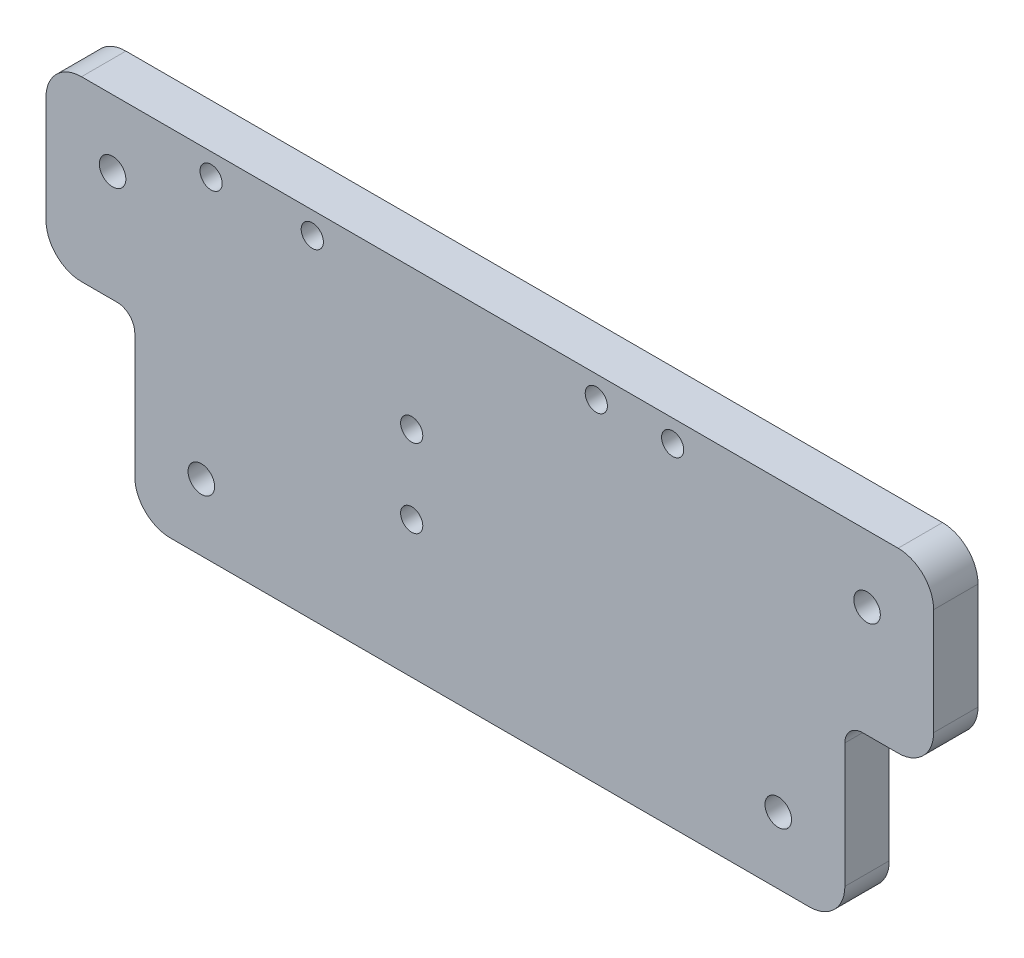
ISO-10303-21;
HEADER;
FILE_DESCRIPTION(('STEP AP214'),'2;1');
FILE_NAME('part.step','',(''),(''),'','','');
FILE_SCHEMA(('AUTOMOTIVE_DESIGN { 1 0 10303 214 1 1 1 1 }'));
ENDSEC;
DATA;
#1=APPLICATION_CONTEXT('core data for automotive mechanical design processes');
#2=APPLICATION_PROTOCOL_DEFINITION('international standard','automotive_design',2000,#1);
#3=PRODUCT_CONTEXT('',#1,'mechanical');
#4=PRODUCT('Part','Part','',(#3));
#5=PRODUCT_RELATED_PRODUCT_CATEGORY('part','',(#4));
#6=PRODUCT_DEFINITION_FORMATION('','',#4);
#7=PRODUCT_DEFINITION_CONTEXT('part definition',#1,'design');
#8=PRODUCT_DEFINITION('design','',#6,#7);
#9=PRODUCT_DEFINITION_SHAPE('','',#8);
#10=(LENGTH_UNIT() NAMED_UNIT(*) SI_UNIT(.MILLI.,.METRE.));
#11=(NAMED_UNIT(*) PLANE_ANGLE_UNIT() SI_UNIT($,.RADIAN.));
#12=(NAMED_UNIT(*) SI_UNIT($,.STERADIAN.) SOLID_ANGLE_UNIT());
#13=UNCERTAINTY_MEASURE_WITH_UNIT(LENGTH_MEASURE(1.E-05),#10,'distance_accuracy_value','');
#14=(GEOMETRIC_REPRESENTATION_CONTEXT(3) GLOBAL_UNCERTAINTY_ASSIGNED_CONTEXT((#13)) GLOBAL_UNIT_ASSIGNED_CONTEXT((#10,
#11,#12)) REPRESENTATION_CONTEXT('',''));
#15=CARTESIAN_POINT('',(0.,0.,0.));
#16=DIRECTION('',(0.,0.,1.));
#17=DIRECTION('',(1.,0.,0.));
#18=AXIS2_PLACEMENT_3D('',#15,#16,#17);
#19=CARTESIAN_POINT('',(114.3,0.,6.35));
#20=DIRECTION('',(1.,0.,0.));
#21=DIRECTION('',(0.,0.,-1.));
#22=AXIS2_PLACEMENT_3D('',#19,#20,#21);
#23=PLANE('',#22);
#24=DIRECTION('',(0.,-1.,0.));
#25=VECTOR('',#24,1.);
#26=CARTESIAN_POINT('',(114.3,0.,0.));
#27=LINE('',#26,#25);
#28=CARTESIAN_POINT('',(114.3,22.86,0.));
#29=VERTEX_POINT('',#28);
#30=CARTESIAN_POINT('',(114.3,5.08,0.));
#31=VERTEX_POINT('',#30);
#32=EDGE_CURVE('E259',#29,#31,#27,.T.);
#33=ORIENTED_EDGE('',*,*,#32,.F.);
#34=DIRECTION('',(0.,0.,-1.));
#35=VECTOR('',#34,1.);
#36=CARTESIAN_POINT('',(114.3,22.86,6.35));
#37=LINE('',#36,#35);
#38=CARTESIAN_POINT('',(114.3,22.86,6.35));
#39=VERTEX_POINT('',#38);
#40=EDGE_CURVE('E228',#29,#39,#37,.F.);
#41=ORIENTED_EDGE('',*,*,#40,.T.);
#42=DIRECTION('',(0.,-1.,0.));
#43=VECTOR('',#42,1.);
#44=CARTESIAN_POINT('',(114.3,0.,6.35));
#45=LINE('',#44,#43);
#46=CARTESIAN_POINT('',(114.3,5.08,6.35));
#47=VERTEX_POINT('',#46);
#48=EDGE_CURVE('E246',#39,#47,#45,.T.);
#49=ORIENTED_EDGE('',*,*,#48,.T.);
#50=DIRECTION('',(0.,0.,-1.));
#51=VECTOR('',#50,1.);
#52=CARTESIAN_POINT('',(114.3,5.08,0.));
#53=LINE('',#52,#51);
#54=EDGE_CURVE('E210',#47,#31,#53,.T.);
#55=ORIENTED_EDGE('',*,*,#54,.T.);
#56=EDGE_LOOP('',(#33,#41,#49,#55));
#57=FACE_BOUND('',#56,.T.);
#58=ADVANCED_FACE('F34',(#57),#23,.T.);
#59=CARTESIAN_POINT('',(0.,25.4,6.35));
#60=DIRECTION('',(0.,-1.,0.));
#61=DIRECTION('',(1.,0.,0.));
#62=AXIS2_PLACEMENT_3D('',#59,#60,#61);
#63=PLANE('',#62);
#64=DIRECTION('',(-1.,0.,0.));
#65=VECTOR('',#64,1.);
#66=CARTESIAN_POINT('',(0.,25.4,6.35));
#67=LINE('',#66,#65);
#68=CARTESIAN_POINT('',(121.92,25.4,6.35));
#69=VERTEX_POINT('',#68);
#70=CARTESIAN_POINT('',(116.84,25.4,6.35));
#71=VERTEX_POINT('',#70);
#72=EDGE_CURVE('E244',#69,#71,#67,.T.);
#73=ORIENTED_EDGE('',*,*,#72,.T.);
#74=DIRECTION('',(0.,0.,-1.));
#75=VECTOR('',#74,1.);
#76=CARTESIAN_POINT('',(116.84,25.4,0.));
#77=LINE('',#76,#75);
#78=CARTESIAN_POINT('',(116.84,25.4,0.));
#79=VERTEX_POINT('',#78);
#80=EDGE_CURVE('E225',#71,#79,#77,.T.);
#81=ORIENTED_EDGE('',*,*,#80,.T.);
#82=DIRECTION('',(-1.,0.,0.));
#83=VECTOR('',#82,1.);
#84=CARTESIAN_POINT('',(0.,25.4,0.));
#85=LINE('',#84,#83);
#86=CARTESIAN_POINT('',(121.92,25.4,0.));
#87=VERTEX_POINT('',#86);
#88=EDGE_CURVE('E261',#87,#79,#85,.T.);
#89=ORIENTED_EDGE('',*,*,#88,.F.);
#90=DIRECTION('',(0.,0.,-1.));
#91=VECTOR('',#90,1.);
#92=CARTESIAN_POINT('',(121.92,25.4,6.35));
#93=LINE('',#92,#91);
#94=EDGE_CURVE('E218',#87,#69,#93,.F.);
#95=ORIENTED_EDGE('',*,*,#94,.T.);
#96=EDGE_LOOP('',(#73,#81,#89,#95));
#97=FACE_BOUND('',#96,.T.);
#98=ADVANCED_FACE('F251',(#97),#63,.T.);
#99=CARTESIAN_POINT('',(127.,0.,6.35));
#100=DIRECTION('',(-1.,0.,0.));
#101=DIRECTION('',(0.,0.,1.));
#102=AXIS2_PLACEMENT_3D('',#99,#100,#101);
#103=PLANE('',#102);
#104=DIRECTION('',(0.,1.,0.));
#105=VECTOR('',#104,1.);
#106=CARTESIAN_POINT('',(127.,0.,6.35));
#107=LINE('',#106,#105);
#108=CARTESIAN_POINT('',(127.,30.48,6.35));
#109=VERTEX_POINT('',#108);
#110=CARTESIAN_POINT('',(127.,45.72,6.35));
#111=VERTEX_POINT('',#110);
#112=EDGE_CURVE('E255',#109,#111,#107,.T.);
#113=ORIENTED_EDGE('',*,*,#112,.F.);
#114=DIRECTION('',(0.,0.,-1.));
#115=VECTOR('',#114,1.);
#116=CARTESIAN_POINT('',(127.,30.48,0.));
#117=LINE('',#116,#115);
#118=CARTESIAN_POINT('',(127.,30.48,0.));
#119=VERTEX_POINT('',#118);
#120=EDGE_CURVE('E215',#109,#119,#117,.T.);
#121=ORIENTED_EDGE('',*,*,#120,.T.);
#122=DIRECTION('',(0.,1.,0.));
#123=VECTOR('',#122,1.);
#124=CARTESIAN_POINT('',(127.,0.,0.));
#125=LINE('',#124,#123);
#126=CARTESIAN_POINT('',(127.,45.72,0.));
#127=VERTEX_POINT('',#126);
#128=EDGE_CURVE('E266',#119,#127,#125,.T.);
#129=ORIENTED_EDGE('',*,*,#128,.T.);
#130=DIRECTION('',(0.,0.,-1.));
#131=VECTOR('',#130,1.);
#132=CARTESIAN_POINT('',(127.,45.72,6.35));
#133=LINE('',#132,#131);
#134=EDGE_CURVE('E213',#127,#111,#133,.F.);
#135=ORIENTED_EDGE('',*,*,#134,.T.);
#136=EDGE_LOOP('',(#113,#121,#129,#135));
#137=FACE_BOUND('',#136,.T.);
#138=ADVANCED_FACE('F351',(#137),#103,.F.);
#139=CARTESIAN_POINT('',(0.,50.8,6.35));
#140=DIRECTION('',(0.,1.,0.));
#141=DIRECTION('',(0.,0.,1.));
#142=AXIS2_PLACEMENT_3D('',#139,#140,#141);
#143=PLANE('',#142);
#144=DIRECTION('',(1.,0.,0.));
#145=VECTOR('',#144,1.);
#146=CARTESIAN_POINT('',(0.,50.8,6.35));
#147=LINE('',#146,#145);
#148=CARTESIAN_POINT('',(5.08,50.8,6.35));
#149=VERTEX_POINT('',#148);
#150=CARTESIAN_POINT('',(121.92,50.8,6.35));
#151=VERTEX_POINT('',#150);
#152=EDGE_CURVE('E289',#149,#151,#147,.T.);
#153=ORIENTED_EDGE('',*,*,#152,.T.);
#154=DIRECTION('',(0.,0.,-1.));
#155=VECTOR('',#154,1.);
#156=CARTESIAN_POINT('',(121.92,50.8,0.));
#157=LINE('',#156,#155);
#158=CARTESIAN_POINT('',(121.92,50.8,0.));
#159=VERTEX_POINT('',#158);
#160=EDGE_CURVE('E222',#151,#159,#157,.T.);
#161=ORIENTED_EDGE('',*,*,#160,.T.);
#162=DIRECTION('',(1.,0.,0.));
#163=VECTOR('',#162,1.);
#164=CARTESIAN_POINT('',(0.,50.8,0.));
#165=LINE('',#164,#163);
#166=CARTESIAN_POINT('',(5.08,50.8,0.));
#167=VERTEX_POINT('',#166);
#168=EDGE_CURVE('E170',#167,#159,#165,.T.);
#169=ORIENTED_EDGE('',*,*,#168,.F.);
#170=DIRECTION('',(0.,0.,-1.));
#171=VECTOR('',#170,1.);
#172=CARTESIAN_POINT('',(5.08,50.8,6.35));
#173=LINE('',#172,#171);
#174=EDGE_CURVE('E220',#167,#149,#173,.F.);
#175=ORIENTED_EDGE('',*,*,#174,.T.);
#176=EDGE_LOOP('',(#153,#161,#169,#175));
#177=FACE_BOUND('',#176,.T.);
#178=ADVANCED_FACE('F280',(#177),#143,.T.);
#179=CARTESIAN_POINT('',(0.,0.,6.35));
#180=DIRECTION('',(-1.,0.,0.));
#181=DIRECTION('',(0.,0.,1.));
#182=AXIS2_PLACEMENT_3D('',#179,#180,#181);
#183=PLANE('',#182);
#184=DIRECTION('',(0.,1.,0.));
#185=VECTOR('',#184,1.);
#186=CARTESIAN_POINT('',(0.,0.,0.));
#187=LINE('',#186,#185);
#188=CARTESIAN_POINT('',(0.,30.48,0.));
#189=VERTEX_POINT('',#188);
#190=CARTESIAN_POINT('',(0.,45.72,0.));
#191=VERTEX_POINT('',#190);
#192=EDGE_CURVE('E166',#189,#191,#187,.T.);
#193=ORIENTED_EDGE('',*,*,#192,.F.);
#194=DIRECTION('',(0.,0.,-1.));
#195=VECTOR('',#194,1.);
#196=CARTESIAN_POINT('',(0.,30.48,6.35));
#197=LINE('',#196,#195);
#198=CARTESIAN_POINT('',(0.,30.48,6.35));
#199=VERTEX_POINT('',#198);
#200=EDGE_CURVE('E152',#189,#199,#197,.F.);
#201=ORIENTED_EDGE('',*,*,#200,.T.);
#202=DIRECTION('',(0.,1.,0.));
#203=VECTOR('',#202,1.);
#204=CARTESIAN_POINT('',(0.,0.,6.35));
#205=LINE('',#204,#203);
#206=CARTESIAN_POINT('',(0.,45.72,6.35));
#207=VERTEX_POINT('',#206);
#208=EDGE_CURVE('E288',#199,#207,#205,.T.);
#209=ORIENTED_EDGE('',*,*,#208,.T.);
#210=DIRECTION('',(0.,0.,-1.));
#211=VECTOR('',#210,1.);
#212=CARTESIAN_POINT('',(0.,45.72,6.35));
#213=LINE('',#212,#211);
#214=EDGE_CURVE('E155',#207,#191,#213,.T.);
#215=ORIENTED_EDGE('',*,*,#214,.T.);
#216=EDGE_LOOP('',(#193,#201,#209,#215));
#217=FACE_BOUND('',#216,.T.);
#218=ADVANCED_FACE('F291',(#217),#183,.T.);
#219=CARTESIAN_POINT('',(0.,25.4,6.35));
#220=DIRECTION('',(0.,1.,0.));
#221=DIRECTION('',(-1.,0.,0.));
#222=AXIS2_PLACEMENT_3D('',#219,#220,#221);
#223=PLANE('',#222);
#224=DIRECTION('',(1.,0.,0.));
#225=VECTOR('',#224,1.);
#226=CARTESIAN_POINT('',(0.,25.4,0.));
#227=LINE('',#226,#225);
#228=CARTESIAN_POINT('',(5.07999999999999,25.4,0.));
#229=VERTEX_POINT('',#228);
#230=CARTESIAN_POINT('',(10.16,25.4,0.));
#231=VERTEX_POINT('',#230);
#232=EDGE_CURVE('E159',#229,#231,#227,.T.);
#233=ORIENTED_EDGE('',*,*,#232,.T.);
#234=DIRECTION('',(0.,0.,-1.));
#235=VECTOR('',#234,1.);
#236=CARTESIAN_POINT('',(10.16,25.4,6.35));
#237=LINE('',#236,#235);
#238=CARTESIAN_POINT('',(10.16,25.4,6.35));
#239=VERTEX_POINT('',#238);
#240=EDGE_CURVE('E55',#231,#239,#237,.F.);
#241=ORIENTED_EDGE('',*,*,#240,.T.);
#242=DIRECTION('',(1.,0.,0.));
#243=VECTOR('',#242,1.);
#244=CARTESIAN_POINT('',(0.,25.4,6.35));
#245=LINE('',#244,#243);
#246=CARTESIAN_POINT('',(5.07999999999999,25.4,6.35));
#247=VERTEX_POINT('',#246);
#248=EDGE_CURVE('E160',#247,#239,#245,.T.);
#249=ORIENTED_EDGE('',*,*,#248,.F.);
#250=DIRECTION('',(0.,0.,-1.));
#251=VECTOR('',#250,1.);
#252=CARTESIAN_POINT('',(5.07999999999999,25.4,0.));
#253=LINE('',#252,#251);
#254=EDGE_CURVE('E151',#247,#229,#253,.T.);
#255=ORIENTED_EDGE('',*,*,#254,.T.);
#256=EDGE_LOOP('',(#233,#241,#249,#255));
#257=FACE_BOUND('',#256,.T.);
#258=ADVANCED_FACE('F158',(#257),#223,.F.);
#259=CARTESIAN_POINT('',(12.7,0.,6.35));
#260=DIRECTION('',(1.,0.,0.));
#261=DIRECTION('',(0.,1.,0.));
#262=AXIS2_PLACEMENT_3D('',#259,#260,#261);
#263=PLANE('',#262);
#264=DIRECTION('',(0.,-1.,0.));
#265=VECTOR('',#264,1.);
#266=CARTESIAN_POINT('',(12.7,0.,6.35));
#267=LINE('',#266,#265);
#268=CARTESIAN_POINT('',(12.7,22.86,6.35));
#269=VERTEX_POINT('',#268);
#270=CARTESIAN_POINT('',(12.7,5.08,6.35));
#271=VERTEX_POINT('',#270);
#272=EDGE_CURVE('E293',#269,#271,#267,.T.);
#273=ORIENTED_EDGE('',*,*,#272,.F.);
#274=DIRECTION('',(0.,0.,-1.));
#275=VECTOR('',#274,1.);
#276=CARTESIAN_POINT('',(12.7,22.86,0.));
#277=LINE('',#276,#275);
#278=CARTESIAN_POINT('',(12.7,22.86,0.));
#279=VERTEX_POINT('',#278);
#280=EDGE_CURVE('E230',#269,#279,#277,.T.);
#281=ORIENTED_EDGE('',*,*,#280,.T.);
#282=DIRECTION('',(0.,-1.,0.));
#283=VECTOR('',#282,1.);
#284=CARTESIAN_POINT('',(12.7,0.,0.));
#285=LINE('',#284,#283);
#286=CARTESIAN_POINT('',(12.7,5.08,0.));
#287=VERTEX_POINT('',#286);
#288=EDGE_CURVE('E165',#279,#287,#285,.T.);
#289=ORIENTED_EDGE('',*,*,#288,.T.);
#290=DIRECTION('',(0.,0.,-1.));
#291=VECTOR('',#290,1.);
#292=CARTESIAN_POINT('',(12.7,5.08,6.35));
#293=LINE('',#292,#291);
#294=EDGE_CURVE('E207',#287,#271,#293,.F.);
#295=ORIENTED_EDGE('',*,*,#294,.T.);
#296=EDGE_LOOP('',(#273,#281,#289,#295));
#297=FACE_BOUND('',#296,.T.);
#298=ADVANCED_FACE('F342',(#297),#263,.F.);
#299=CARTESIAN_POINT('',(23.622,47.625,6.35));
#300=DIRECTION('',(0.,0.,-1.));
#301=DIRECTION('',(-1.,0.,0.));
#302=AXIS2_PLACEMENT_3D('',#299,#300,#301);
#303=CYLINDRICAL_SURFACE('',#302,1.5875);
#304=CARTESIAN_POINT('',(23.622,47.625,6.35));
#305=DIRECTION('',(0.,0.,1.));
#306=DIRECTION('',(1.,0.,0.));
#307=AXIS2_PLACEMENT_3D('',#304,#305,#306);
#308=CIRCLE('',#307,1.5875);
#309=CARTESIAN_POINT('',(25.2095,47.625,6.35));
#310=VERTEX_POINT('',#309);
#311=EDGE_CURVE('E414',#310,#310,#308,.T.);
#312=ORIENTED_EDGE('',*,*,#311,.T.);
#313=EDGE_LOOP('',(#312));
#314=FACE_BOUND('',#313,.T.);
#315=CARTESIAN_POINT('',(23.622,47.625,0.));
#316=DIRECTION('',(0.,0.,1.));
#317=DIRECTION('',(1.,0.,0.));
#318=AXIS2_PLACEMENT_3D('',#315,#316,#317);
#319=CIRCLE('',#318,1.5875);
#320=CARTESIAN_POINT('',(25.2095,47.625,0.));
#321=VERTEX_POINT('',#320);
#322=EDGE_CURVE('E264',#321,#321,#319,.T.);
#323=ORIENTED_EDGE('',*,*,#322,.F.);
#324=EDGE_LOOP('',(#323));
#325=FACE_BOUND('',#324,.T.);
#326=ADVANCED_FACE('F332',(#314,#325),#303,.F.);
#327=CARTESIAN_POINT('',(38.1,47.625,6.35));
#328=DIRECTION('',(0.,0.,-1.));
#329=DIRECTION('',(-1.,0.,0.));
#330=AXIS2_PLACEMENT_3D('',#327,#328,#329);
#331=CYLINDRICAL_SURFACE('',#330,1.5875);
#332=CARTESIAN_POINT('',(38.1,47.625,6.35));
#333=DIRECTION('',(0.,0.,1.));
#334=DIRECTION('',(1.,0.,0.));
#335=AXIS2_PLACEMENT_3D('',#332,#333,#334);
#336=CIRCLE('',#335,1.5875);
#337=CARTESIAN_POINT('',(39.6875,47.625,6.35));
#338=VERTEX_POINT('',#337);
#339=EDGE_CURVE('E411',#338,#338,#336,.T.);
#340=ORIENTED_EDGE('',*,*,#339,.T.);
#341=EDGE_LOOP('',(#340));
#342=FACE_BOUND('',#341,.T.);
#343=CARTESIAN_POINT('',(38.1,47.625,0.));
#344=DIRECTION('',(0.,0.,1.));
#345=DIRECTION('',(1.,0.,0.));
#346=AXIS2_PLACEMENT_3D('',#343,#344,#345);
#347=CIRCLE('',#346,1.5875);
#348=CARTESIAN_POINT('',(39.6875,47.625,0.));
#349=VERTEX_POINT('',#348);
#350=EDGE_CURVE('E269',#349,#349,#347,.T.);
#351=ORIENTED_EDGE('',*,*,#350,.F.);
#352=EDGE_LOOP('',(#351));
#353=FACE_BOUND('',#352,.T.);
#354=ADVANCED_FACE('F329',(#342,#353),#331,.F.);
#355=CARTESIAN_POINT('',(78.74,47.625,6.35));
#356=DIRECTION('',(0.,0.,-1.));
#357=DIRECTION('',(-1.,0.,0.));
#358=AXIS2_PLACEMENT_3D('',#355,#356,#357);
#359=CYLINDRICAL_SURFACE('',#358,1.58749999999999);
#360=CARTESIAN_POINT('',(78.74,47.625,6.35));
#361=DIRECTION('',(0.,0.,1.));
#362=DIRECTION('',(1.,0.,0.));
#363=AXIS2_PLACEMENT_3D('',#360,#361,#362);
#364=CIRCLE('',#363,1.58749999999999);
#365=CARTESIAN_POINT('',(80.3275,47.625,6.35));
#366=VERTEX_POINT('',#365);
#367=EDGE_CURVE('E408',#366,#366,#364,.T.);
#368=ORIENTED_EDGE('',*,*,#367,.T.);
#369=EDGE_LOOP('',(#368));
#370=FACE_BOUND('',#369,.T.);
#371=CARTESIAN_POINT('',(78.74,47.625,0.));
#372=DIRECTION('',(0.,0.,1.));
#373=DIRECTION('',(1.,0.,0.));
#374=AXIS2_PLACEMENT_3D('',#371,#372,#373);
#375=CIRCLE('',#374,1.58749999999999);
#376=CARTESIAN_POINT('',(80.3275,47.625,0.));
#377=VERTEX_POINT('',#376);
#378=EDGE_CURVE('E322',#377,#377,#375,.T.);
#379=ORIENTED_EDGE('',*,*,#378,.F.);
#380=EDGE_LOOP('',(#379));
#381=FACE_BOUND('',#380,.T.);
#382=ADVANCED_FACE('F331',(#370,#381),#359,.F.);
#383=CARTESIAN_POINT('',(89.662,47.625,6.35));
#384=DIRECTION('',(0.,0.,-1.));
#385=DIRECTION('',(-1.,0.,0.));
#386=AXIS2_PLACEMENT_3D('',#383,#384,#385);
#387=CYLINDRICAL_SURFACE('',#386,1.5875);
#388=CARTESIAN_POINT('',(89.662,47.625,6.35));
#389=DIRECTION('',(0.,0.,1.));
#390=DIRECTION('',(1.,0.,0.));
#391=AXIS2_PLACEMENT_3D('',#388,#389,#390);
#392=CIRCLE('',#391,1.5875);
#393=CARTESIAN_POINT('',(91.2495,47.625,6.35));
#394=VERTEX_POINT('',#393);
#395=EDGE_CURVE('E404',#394,#394,#392,.T.);
#396=ORIENTED_EDGE('',*,*,#395,.T.);
#397=EDGE_LOOP('',(#396));
#398=FACE_BOUND('',#397,.T.);
#399=CARTESIAN_POINT('',(89.662,47.625,0.));
#400=DIRECTION('',(0.,0.,1.));
#401=DIRECTION('',(1.,0.,0.));
#402=AXIS2_PLACEMENT_3D('',#399,#400,#401);
#403=CIRCLE('',#402,1.5875);
#404=CARTESIAN_POINT('',(91.2495,47.625,0.));
#405=VERTEX_POINT('',#404);
#406=EDGE_CURVE('E319',#405,#405,#403,.T.);
#407=ORIENTED_EDGE('',*,*,#406,.F.);
#408=EDGE_LOOP('',(#407));
#409=FACE_BOUND('',#408,.T.);
#410=ADVANCED_FACE('F339',(#398,#409),#387,.F.);
#411=CARTESIAN_POINT('',(52.324,30.734,6.35));
#412=DIRECTION('',(0.,0.,-1.));
#413=DIRECTION('',(-1.,0.,0.));
#414=AXIS2_PLACEMENT_3D('',#411,#412,#413);
#415=CYLINDRICAL_SURFACE('',#414,1.5875);
#416=CARTESIAN_POINT('',(52.324,30.734,6.35));
#417=DIRECTION('',(0.,0.,1.));
#418=DIRECTION('',(1.,0.,0.));
#419=AXIS2_PLACEMENT_3D('',#416,#417,#418);
#420=CIRCLE('',#419,1.5875);
#421=CARTESIAN_POINT('',(53.9115,30.734,6.35));
#422=VERTEX_POINT('',#421);
#423=EDGE_CURVE('E400',#422,#422,#420,.T.);
#424=ORIENTED_EDGE('',*,*,#423,.T.);
#425=EDGE_LOOP('',(#424));
#426=FACE_BOUND('',#425,.T.);
#427=CARTESIAN_POINT('',(52.324,30.734,0.));
#428=DIRECTION('',(0.,0.,1.));
#429=DIRECTION('',(1.,0.,0.));
#430=AXIS2_PLACEMENT_3D('',#427,#428,#429);
#431=CIRCLE('',#430,1.5875);
#432=CARTESIAN_POINT('',(53.9115,30.734,0.));
#433=VERTEX_POINT('',#432);
#434=EDGE_CURVE('E316',#433,#433,#431,.T.);
#435=ORIENTED_EDGE('',*,*,#434,.F.);
#436=EDGE_LOOP('',(#435));
#437=FACE_BOUND('',#436,.T.);
#438=ADVANCED_FACE('F484',(#426,#437),#415,.F.);
#439=CARTESIAN_POINT('',(52.324,19.558,6.35));
#440=DIRECTION('',(0.,0.,-1.));
#441=DIRECTION('',(-1.,0.,0.));
#442=AXIS2_PLACEMENT_3D('',#439,#440,#441);
#443=CYLINDRICAL_SURFACE('',#442,1.5875);
#444=CARTESIAN_POINT('',(52.324,19.558,6.35));
#445=DIRECTION('',(0.,0.,1.));
#446=DIRECTION('',(1.,0.,0.));
#447=AXIS2_PLACEMENT_3D('',#444,#445,#446);
#448=CIRCLE('',#447,1.5875);
#449=CARTESIAN_POINT('',(53.9115,19.558,6.35));
#450=VERTEX_POINT('',#449);
#451=EDGE_CURVE('E396',#450,#450,#448,.T.);
#452=ORIENTED_EDGE('',*,*,#451,.T.);
#453=EDGE_LOOP('',(#452));
#454=FACE_BOUND('',#453,.T.);
#455=CARTESIAN_POINT('',(52.324,19.558,0.));
#456=DIRECTION('',(0.,0.,1.));
#457=DIRECTION('',(1.,0.,0.));
#458=AXIS2_PLACEMENT_3D('',#455,#456,#457);
#459=CIRCLE('',#458,1.5875);
#460=CARTESIAN_POINT('',(53.9115,19.558,0.));
#461=VERTEX_POINT('',#460);
#462=EDGE_CURVE('E313',#461,#461,#459,.T.);
#463=ORIENTED_EDGE('',*,*,#462,.F.);
#464=EDGE_LOOP('',(#463));
#465=FACE_BOUND('',#464,.T.);
#466=ADVANCED_FACE('F480',(#454,#465),#443,.F.);
#467=CARTESIAN_POINT('',(9.525,41.275,6.35));
#468=DIRECTION('',(0.,0.,-1.));
#469=DIRECTION('',(-1.,0.,0.));
#470=AXIS2_PLACEMENT_3D('',#467,#468,#469);
#471=CYLINDRICAL_SURFACE('',#470,1.89865);
#472=CARTESIAN_POINT('',(9.525,41.275,6.35));
#473=DIRECTION('',(0.,0.,1.));
#474=DIRECTION('',(1.,0.,0.));
#475=AXIS2_PLACEMENT_3D('',#472,#473,#474);
#476=CIRCLE('',#475,1.89865);
#477=CARTESIAN_POINT('',(11.42365,41.275,6.35));
#478=VERTEX_POINT('',#477);
#479=EDGE_CURVE('E392',#478,#478,#476,.T.);
#480=ORIENTED_EDGE('',*,*,#479,.T.);
#481=EDGE_LOOP('',(#480));
#482=FACE_BOUND('',#481,.T.);
#483=CARTESIAN_POINT('',(9.525,41.275,0.));
#484=DIRECTION('',(0.,0.,1.));
#485=DIRECTION('',(1.,0.,0.));
#486=AXIS2_PLACEMENT_3D('',#483,#484,#485);
#487=CIRCLE('',#486,1.89865);
#488=CARTESIAN_POINT('',(11.42365,41.275,0.));
#489=VERTEX_POINT('',#488);
#490=EDGE_CURVE('E310',#489,#489,#487,.T.);
#491=ORIENTED_EDGE('',*,*,#490,.F.);
#492=EDGE_LOOP('',(#491));
#493=FACE_BOUND('',#492,.T.);
#494=ADVANCED_FACE('F476',(#482,#493),#471,.F.);
#495=CARTESIAN_POINT('',(22.225,9.525,6.35));
#496=DIRECTION('',(0.,0.,-1.));
#497=DIRECTION('',(-1.,0.,0.));
#498=AXIS2_PLACEMENT_3D('',#495,#496,#497);
#499=CYLINDRICAL_SURFACE('',#498,1.89865);
#500=CARTESIAN_POINT('',(22.225,9.525,6.35));
#501=DIRECTION('',(0.,0.,1.));
#502=DIRECTION('',(1.,0.,0.));
#503=AXIS2_PLACEMENT_3D('',#500,#501,#502);
#504=CIRCLE('',#503,1.89865);
#505=CARTESIAN_POINT('',(24.12365,9.525,6.35));
#506=VERTEX_POINT('',#505);
#507=EDGE_CURVE('E388',#506,#506,#504,.T.);
#508=ORIENTED_EDGE('',*,*,#507,.T.);
#509=EDGE_LOOP('',(#508));
#510=FACE_BOUND('',#509,.T.);
#511=CARTESIAN_POINT('',(22.225,9.525,0.));
#512=DIRECTION('',(0.,0.,1.));
#513=DIRECTION('',(1.,0.,0.));
#514=AXIS2_PLACEMENT_3D('',#511,#512,#513);
#515=CIRCLE('',#514,1.89865);
#516=CARTESIAN_POINT('',(24.12365,9.525,0.));
#517=VERTEX_POINT('',#516);
#518=EDGE_CURVE('E307',#517,#517,#515,.T.);
#519=ORIENTED_EDGE('',*,*,#518,.F.);
#520=EDGE_LOOP('',(#519));
#521=FACE_BOUND('',#520,.T.);
#522=ADVANCED_FACE('F472',(#510,#521),#499,.F.);
#523=CARTESIAN_POINT('',(104.775,9.525,6.35));
#524=DIRECTION('',(0.,0.,-1.));
#525=DIRECTION('',(-1.,0.,0.));
#526=AXIS2_PLACEMENT_3D('',#523,#524,#525);
#527=CYLINDRICAL_SURFACE('',#526,1.89865000000001);
#528=CARTESIAN_POINT('',(104.775,9.525,6.35));
#529=DIRECTION('',(0.,0.,1.));
#530=DIRECTION('',(1.,0.,0.));
#531=AXIS2_PLACEMENT_3D('',#528,#529,#530);
#532=CIRCLE('',#531,1.89865000000001);
#533=CARTESIAN_POINT('',(106.67365,9.525,6.35));
#534=VERTEX_POINT('',#533);
#535=EDGE_CURVE('E384',#534,#534,#532,.T.);
#536=ORIENTED_EDGE('',*,*,#535,.T.);
#537=EDGE_LOOP('',(#536));
#538=FACE_BOUND('',#537,.T.);
#539=CARTESIAN_POINT('',(104.775,9.525,0.));
#540=DIRECTION('',(0.,0.,1.));
#541=DIRECTION('',(1.,0.,0.));
#542=AXIS2_PLACEMENT_3D('',#539,#540,#541);
#543=CIRCLE('',#542,1.89865000000001);
#544=CARTESIAN_POINT('',(106.67365,9.525,0.));
#545=VERTEX_POINT('',#544);
#546=EDGE_CURVE('E304',#545,#545,#543,.T.);
#547=ORIENTED_EDGE('',*,*,#546,.F.);
#548=EDGE_LOOP('',(#547));
#549=FACE_BOUND('',#548,.T.);
#550=ADVANCED_FACE('F468',(#538,#549),#527,.F.);
#551=CARTESIAN_POINT('',(117.475,41.275,6.35));
#552=DIRECTION('',(0.,0.,-1.));
#553=DIRECTION('',(-1.,0.,0.));
#554=AXIS2_PLACEMENT_3D('',#551,#552,#553);
#555=CYLINDRICAL_SURFACE('',#554,1.89864999999999);
#556=CARTESIAN_POINT('',(117.475,41.275,6.35));
#557=DIRECTION('',(0.,0.,1.));
#558=DIRECTION('',(1.,0.,0.));
#559=AXIS2_PLACEMENT_3D('',#556,#557,#558);
#560=CIRCLE('',#559,1.89864999999999);
#561=CARTESIAN_POINT('',(119.37365,41.275,6.35));
#562=VERTEX_POINT('',#561);
#563=EDGE_CURVE('E175',#562,#562,#560,.T.);
#564=ORIENTED_EDGE('',*,*,#563,.T.);
#565=EDGE_LOOP('',(#564));
#566=FACE_BOUND('',#565,.T.);
#567=CARTESIAN_POINT('',(117.475,41.275,0.));
#568=DIRECTION('',(0.,0.,1.));
#569=DIRECTION('',(1.,0.,0.));
#570=AXIS2_PLACEMENT_3D('',#567,#568,#569);
#571=CIRCLE('',#570,1.89864999999999);
#572=CARTESIAN_POINT('',(119.37365,41.275,0.));
#573=VERTEX_POINT('',#572);
#574=EDGE_CURVE('E301',#573,#573,#571,.T.);
#575=ORIENTED_EDGE('',*,*,#574,.F.);
#576=EDGE_LOOP('',(#575));
#577=FACE_BOUND('',#576,.T.);
#578=ADVANCED_FACE('F369',(#566,#577),#555,.F.);
#579=CARTESIAN_POINT('',(0.,0.,6.35));
#580=DIRECTION('',(0.,1.,0.));
#581=DIRECTION('',(0.,0.,1.));
#582=AXIS2_PLACEMENT_3D('',#579,#580,#581);
#583=PLANE('',#582);
#584=DIRECTION('',(1.,0.,0.));
#585=VECTOR('',#584,1.);
#586=CARTESIAN_POINT('',(0.,0.,6.35));
#587=LINE('',#586,#585);
#588=CARTESIAN_POINT('',(17.78,0.,6.35));
#589=VERTEX_POINT('',#588);
#590=CARTESIAN_POINT('',(109.22,0.,6.35));
#591=VERTEX_POINT('',#590);
#592=EDGE_CURVE('E162',#589,#591,#587,.T.);
#593=ORIENTED_EDGE('',*,*,#592,.F.);
#594=DIRECTION('',(0.,0.,-1.));
#595=VECTOR('',#594,1.);
#596=CARTESIAN_POINT('',(17.78,0.,6.35));
#597=LINE('',#596,#595);
#598=CARTESIAN_POINT('',(17.78,0.,0.));
#599=VERTEX_POINT('',#598);
#600=EDGE_CURVE('E204',#589,#599,#597,.T.);
#601=ORIENTED_EDGE('',*,*,#600,.T.);
#602=DIRECTION('',(1.,0.,0.));
#603=VECTOR('',#602,1.);
#604=CARTESIAN_POINT('',(0.,0.,0.));
#605=LINE('',#604,#603);
#606=CARTESIAN_POINT('',(109.22,0.,0.));
#607=VERTEX_POINT('',#606);
#608=EDGE_CURVE('E168',#599,#607,#605,.T.);
#609=ORIENTED_EDGE('',*,*,#608,.T.);
#610=DIRECTION('',(0.,0.,-1.));
#611=VECTOR('',#610,1.);
#612=CARTESIAN_POINT('',(109.22,0.,6.35));
#613=LINE('',#612,#611);
#614=EDGE_CURVE('E202',#607,#591,#613,.F.);
#615=ORIENTED_EDGE('',*,*,#614,.T.);
#616=EDGE_LOOP('',(#593,#601,#609,#615));
#617=FACE_BOUND('',#616,.T.);
#618=ADVANCED_FACE('F366',(#617),#583,.F.);
#619=CARTESIAN_POINT('',(0.,0.,6.35));
#620=DIRECTION('',(0.,0.,1.));
#621=DIRECTION('',(1.,0.,0.));
#622=AXIS2_PLACEMENT_3D('',#619,#620,#621);
#623=PLANE('',#622);
#624=ORIENTED_EDGE('',*,*,#563,.F.);
#625=EDGE_LOOP('',(#624));
#626=FACE_BOUND('',#625,.T.);
#627=ORIENTED_EDGE('',*,*,#535,.F.);
#628=EDGE_LOOP('',(#627));
#629=FACE_BOUND('',#628,.T.);
#630=ORIENTED_EDGE('',*,*,#507,.F.);
#631=EDGE_LOOP('',(#630));
#632=FACE_BOUND('',#631,.T.);
#633=ORIENTED_EDGE('',*,*,#479,.F.);
#634=EDGE_LOOP('',(#633));
#635=FACE_BOUND('',#634,.T.);
#636=ORIENTED_EDGE('',*,*,#451,.F.);
#637=EDGE_LOOP('',(#636));
#638=FACE_BOUND('',#637,.T.);
#639=ORIENTED_EDGE('',*,*,#423,.F.);
#640=EDGE_LOOP('',(#639));
#641=FACE_BOUND('',#640,.T.);
#642=ORIENTED_EDGE('',*,*,#395,.F.);
#643=EDGE_LOOP('',(#642));
#644=FACE_BOUND('',#643,.T.);
#645=ORIENTED_EDGE('',*,*,#367,.F.);
#646=EDGE_LOOP('',(#645));
#647=FACE_BOUND('',#646,.T.);
#648=ORIENTED_EDGE('',*,*,#339,.F.);
#649=EDGE_LOOP('',(#648));
#650=FACE_BOUND('',#649,.T.);
#651=ORIENTED_EDGE('',*,*,#311,.F.);
#652=EDGE_LOOP('',(#651));
#653=FACE_BOUND('',#652,.T.);
#654=ORIENTED_EDGE('',*,*,#208,.F.);
#655=CARTESIAN_POINT('',(5.08,30.48,6.35));
#656=DIRECTION('',(0.,0.,1.));
#657=DIRECTION('',(1.,0.,0.));
#658=AXIS2_PLACEMENT_3D('',#655,#656,#657);
#659=CIRCLE('',#658,5.08);
#660=EDGE_CURVE('E200',#199,#247,#659,.T.);
#661=ORIENTED_EDGE('',*,*,#660,.T.);
#662=ORIENTED_EDGE('',*,*,#248,.T.);
#663=CARTESIAN_POINT('',(10.16,22.86,6.35));
#664=DIRECTION('',(0.,0.,1.));
#665=DIRECTION('',(1.,0.,0.));
#666=AXIS2_PLACEMENT_3D('',#663,#664,#665);
#667=CIRCLE('',#666,2.54);
#668=EDGE_CURVE('E11',#239,#269,#667,.F.);
#669=ORIENTED_EDGE('',*,*,#668,.T.);
#670=ORIENTED_EDGE('',*,*,#272,.T.);
#671=CARTESIAN_POINT('',(17.78,5.08,6.35));
#672=DIRECTION('',(0.,0.,1.));
#673=DIRECTION('',(1.,0.,0.));
#674=AXIS2_PLACEMENT_3D('',#671,#672,#673);
#675=CIRCLE('',#674,5.08);
#676=EDGE_CURVE('E198',#271,#589,#675,.T.);
#677=ORIENTED_EDGE('',*,*,#676,.T.);
#678=ORIENTED_EDGE('',*,*,#592,.T.);
#679=CARTESIAN_POINT('',(109.22,5.08,6.35));
#680=DIRECTION('',(0.,0.,1.));
#681=DIRECTION('',(1.,0.,0.));
#682=AXIS2_PLACEMENT_3D('',#679,#680,#681);
#683=CIRCLE('',#682,5.08);
#684=EDGE_CURVE('E195',#591,#47,#683,.T.);
#685=ORIENTED_EDGE('',*,*,#684,.T.);
#686=ORIENTED_EDGE('',*,*,#48,.F.);
#687=CARTESIAN_POINT('',(116.84,22.86,6.35));
#688=DIRECTION('',(0.,0.,1.));
#689=DIRECTION('',(1.,0.,0.));
#690=AXIS2_PLACEMENT_3D('',#687,#688,#689);
#691=CIRCLE('',#690,2.54);
#692=EDGE_CURVE('E236',#39,#71,#691,.F.);
#693=ORIENTED_EDGE('',*,*,#692,.T.);
#694=ORIENTED_EDGE('',*,*,#72,.F.);
#695=CARTESIAN_POINT('',(121.92,30.48,6.35));
#696=DIRECTION('',(0.,0.,1.));
#697=DIRECTION('',(1.,0.,0.));
#698=AXIS2_PLACEMENT_3D('',#695,#696,#697);
#699=CIRCLE('',#698,5.08);
#700=EDGE_CURVE('E193',#69,#109,#699,.T.);
#701=ORIENTED_EDGE('',*,*,#700,.T.);
#702=ORIENTED_EDGE('',*,*,#112,.T.);
#703=CARTESIAN_POINT('',(121.92,45.72,6.35));
#704=DIRECTION('',(0.,0.,1.));
#705=DIRECTION('',(1.,0.,0.));
#706=AXIS2_PLACEMENT_3D('',#703,#704,#705);
#707=CIRCLE('',#706,5.08);
#708=EDGE_CURVE('E191',#111,#151,#707,.T.);
#709=ORIENTED_EDGE('',*,*,#708,.T.);
#710=ORIENTED_EDGE('',*,*,#152,.F.);
#711=CARTESIAN_POINT('',(5.08,45.72,6.35));
#712=DIRECTION('',(0.,0.,1.));
#713=DIRECTION('',(1.,0.,0.));
#714=AXIS2_PLACEMENT_3D('',#711,#712,#713);
#715=CIRCLE('',#714,5.08);
#716=EDGE_CURVE('E189',#149,#207,#715,.T.);
#717=ORIENTED_EDGE('',*,*,#716,.T.);
#718=EDGE_LOOP('',(#654,#661,#662,#669,#670,#677,#678,#685,#686,#693,#694,#701,#702,#709,#710,#717));
#719=FACE_BOUND('',#718,.T.);
#720=ADVANCED_FACE('F243',(#626,#629,#632,#635,#638,#641,#644,#647,#650,#653,#719),#623,.T.);
#721=CARTESIAN_POINT('',(0.,0.,0.));
#722=DIRECTION('',(0.,0.,1.));
#723=DIRECTION('',(1.,0.,0.));
#724=AXIS2_PLACEMENT_3D('',#721,#722,#723);
#725=PLANE('',#724);
#726=ORIENTED_EDGE('',*,*,#574,.T.);
#727=EDGE_LOOP('',(#726));
#728=FACE_BOUND('',#727,.T.);
#729=ORIENTED_EDGE('',*,*,#546,.T.);
#730=EDGE_LOOP('',(#729));
#731=FACE_BOUND('',#730,.T.);
#732=ORIENTED_EDGE('',*,*,#518,.T.);
#733=EDGE_LOOP('',(#732));
#734=FACE_BOUND('',#733,.T.);
#735=ORIENTED_EDGE('',*,*,#490,.T.);
#736=EDGE_LOOP('',(#735));
#737=FACE_BOUND('',#736,.T.);
#738=ORIENTED_EDGE('',*,*,#462,.T.);
#739=EDGE_LOOP('',(#738));
#740=FACE_BOUND('',#739,.T.);
#741=ORIENTED_EDGE('',*,*,#434,.T.);
#742=EDGE_LOOP('',(#741));
#743=FACE_BOUND('',#742,.T.);
#744=ORIENTED_EDGE('',*,*,#406,.T.);
#745=EDGE_LOOP('',(#744));
#746=FACE_BOUND('',#745,.T.);
#747=ORIENTED_EDGE('',*,*,#378,.T.);
#748=EDGE_LOOP('',(#747));
#749=FACE_BOUND('',#748,.T.);
#750=ORIENTED_EDGE('',*,*,#350,.T.);
#751=EDGE_LOOP('',(#750));
#752=FACE_BOUND('',#751,.T.);
#753=ORIENTED_EDGE('',*,*,#322,.T.);
#754=EDGE_LOOP('',(#753));
#755=FACE_BOUND('',#754,.T.);
#756=ORIENTED_EDGE('',*,*,#232,.F.);
#757=CARTESIAN_POINT('',(5.08,30.48,0.));
#758=DIRECTION('',(0.,0.,1.));
#759=DIRECTION('',(1.,0.,0.));
#760=AXIS2_PLACEMENT_3D('',#757,#758,#759);
#761=CIRCLE('',#760,5.08);
#762=EDGE_CURVE('E147',#229,#189,#761,.F.);
#763=ORIENTED_EDGE('',*,*,#762,.T.);
#764=ORIENTED_EDGE('',*,*,#192,.T.);
#765=CARTESIAN_POINT('',(5.08,45.72,0.));
#766=DIRECTION('',(0.,0.,1.));
#767=DIRECTION('',(1.,0.,0.));
#768=AXIS2_PLACEMENT_3D('',#765,#766,#767);
#769=CIRCLE('',#768,5.08);
#770=EDGE_CURVE('E161',#191,#167,#769,.F.);
#771=ORIENTED_EDGE('',*,*,#770,.T.);
#772=ORIENTED_EDGE('',*,*,#168,.T.);
#773=CARTESIAN_POINT('',(121.92,45.72,0.));
#774=DIRECTION('',(0.,0.,1.));
#775=DIRECTION('',(1.,0.,0.));
#776=AXIS2_PLACEMENT_3D('',#773,#774,#775);
#777=CIRCLE('',#776,5.08);
#778=EDGE_CURVE('E178',#159,#127,#777,.F.);
#779=ORIENTED_EDGE('',*,*,#778,.T.);
#780=ORIENTED_EDGE('',*,*,#128,.F.);
#781=CARTESIAN_POINT('',(121.92,30.48,0.));
#782=DIRECTION('',(0.,0.,1.));
#783=DIRECTION('',(1.,0.,0.));
#784=AXIS2_PLACEMENT_3D('',#781,#782,#783);
#785=CIRCLE('',#784,5.08);
#786=EDGE_CURVE('E180',#119,#87,#785,.F.);
#787=ORIENTED_EDGE('',*,*,#786,.T.);
#788=ORIENTED_EDGE('',*,*,#88,.T.);
#789=CARTESIAN_POINT('',(116.84,22.86,0.));
#790=DIRECTION('',(0.,0.,1.));
#791=DIRECTION('',(1.,0.,0.));
#792=AXIS2_PLACEMENT_3D('',#789,#790,#791);
#793=CIRCLE('',#792,2.54);
#794=EDGE_CURVE('E234',#79,#29,#793,.T.);
#795=ORIENTED_EDGE('',*,*,#794,.T.);
#796=ORIENTED_EDGE('',*,*,#32,.T.);
#797=CARTESIAN_POINT('',(109.22,5.08,0.));
#798=DIRECTION('',(0.,0.,1.));
#799=DIRECTION('',(1.,0.,0.));
#800=AXIS2_PLACEMENT_3D('',#797,#798,#799);
#801=CIRCLE('',#800,5.08);
#802=EDGE_CURVE('E182',#31,#607,#801,.F.);
#803=ORIENTED_EDGE('',*,*,#802,.T.);
#804=ORIENTED_EDGE('',*,*,#608,.F.);
#805=CARTESIAN_POINT('',(17.78,5.08,0.));
#806=DIRECTION('',(0.,0.,1.));
#807=DIRECTION('',(1.,0.,0.));
#808=AXIS2_PLACEMENT_3D('',#805,#806,#807);
#809=CIRCLE('',#808,5.08);
#810=EDGE_CURVE('E156',#599,#287,#809,.F.);
#811=ORIENTED_EDGE('',*,*,#810,.T.);
#812=ORIENTED_EDGE('',*,*,#288,.F.);
#813=CARTESIAN_POINT('',(10.16,22.86,0.));
#814=DIRECTION('',(0.,0.,1.));
#815=DIRECTION('',(1.,0.,0.));
#816=AXIS2_PLACEMENT_3D('',#813,#814,#815);
#817=CIRCLE('',#816,2.54);
#818=EDGE_CURVE('E42',#279,#231,#817,.T.);
#819=ORIENTED_EDGE('',*,*,#818,.T.);
#820=EDGE_LOOP('',(#756,#763,#764,#771,#772,#779,#780,#787,#788,#795,#796,#803,#804,#811,#812,#819));
#821=FACE_BOUND('',#820,.T.);
#822=ADVANCED_FACE('F164',(#728,#731,#734,#737,#740,#743,#746,#749,#752,#755,#821),#725,.F.);
#823=CARTESIAN_POINT('',(5.08,30.48,6.35));
#824=DIRECTION('',(0.,0.,1.));
#825=DIRECTION('',(1.,0.,0.));
#826=AXIS2_PLACEMENT_3D('',#823,#824,#825);
#827=CYLINDRICAL_SURFACE('',#826,5.08);
#828=ORIENTED_EDGE('',*,*,#660,.F.);
#829=ORIENTED_EDGE('',*,*,#200,.F.);
#830=ORIENTED_EDGE('',*,*,#762,.F.);
#831=ORIENTED_EDGE('',*,*,#254,.F.);
#832=EDGE_LOOP('',(#828,#829,#830,#831));
#833=FACE_BOUND('',#832,.T.);
#834=ADVANCED_FACE('F150',(#833),#827,.T.);
#835=CARTESIAN_POINT('',(17.78,5.08,6.35));
#836=DIRECTION('',(0.,0.,-1.));
#837=DIRECTION('',(-1.,0.,0.));
#838=AXIS2_PLACEMENT_3D('',#835,#836,#837);
#839=CYLINDRICAL_SURFACE('',#838,5.08);
#840=ORIENTED_EDGE('',*,*,#676,.F.);
#841=ORIENTED_EDGE('',*,*,#294,.F.);
#842=ORIENTED_EDGE('',*,*,#810,.F.);
#843=ORIENTED_EDGE('',*,*,#600,.F.);
#844=EDGE_LOOP('',(#840,#841,#842,#843));
#845=FACE_BOUND('',#844,.T.);
#846=ADVANCED_FACE('F436',(#845),#839,.T.);
#847=CARTESIAN_POINT('',(109.22,5.08,6.35));
#848=DIRECTION('',(0.,0.,1.));
#849=DIRECTION('',(1.,0.,0.));
#850=AXIS2_PLACEMENT_3D('',#847,#848,#849);
#851=CYLINDRICAL_SURFACE('',#850,5.08);
#852=ORIENTED_EDGE('',*,*,#684,.F.);
#853=ORIENTED_EDGE('',*,*,#614,.F.);
#854=ORIENTED_EDGE('',*,*,#802,.F.);
#855=ORIENTED_EDGE('',*,*,#54,.F.);
#856=EDGE_LOOP('',(#852,#853,#854,#855));
#857=FACE_BOUND('',#856,.T.);
#858=ADVANCED_FACE('F429',(#857),#851,.T.);
#859=CARTESIAN_POINT('',(121.92,30.48,6.35));
#860=DIRECTION('',(0.,0.,1.));
#861=DIRECTION('',(1.,0.,0.));
#862=AXIS2_PLACEMENT_3D('',#859,#860,#861);
#863=CYLINDRICAL_SURFACE('',#862,5.08);
#864=ORIENTED_EDGE('',*,*,#700,.F.);
#865=ORIENTED_EDGE('',*,*,#94,.F.);
#866=ORIENTED_EDGE('',*,*,#786,.F.);
#867=ORIENTED_EDGE('',*,*,#120,.F.);
#868=EDGE_LOOP('',(#864,#865,#866,#867));
#869=FACE_BOUND('',#868,.T.);
#870=ADVANCED_FACE('F427',(#869),#863,.T.);
#871=CARTESIAN_POINT('',(121.92,45.72,6.35));
#872=DIRECTION('',(0.,0.,1.));
#873=DIRECTION('',(1.,0.,0.));
#874=AXIS2_PLACEMENT_3D('',#871,#872,#873);
#875=CYLINDRICAL_SURFACE('',#874,5.08);
#876=ORIENTED_EDGE('',*,*,#708,.F.);
#877=ORIENTED_EDGE('',*,*,#134,.F.);
#878=ORIENTED_EDGE('',*,*,#778,.F.);
#879=ORIENTED_EDGE('',*,*,#160,.F.);
#880=EDGE_LOOP('',(#876,#877,#878,#879));
#881=FACE_BOUND('',#880,.T.);
#882=ADVANCED_FACE('F425',(#881),#875,.T.);
#883=CARTESIAN_POINT('',(5.08,45.72,6.35));
#884=DIRECTION('',(0.,0.,-1.));
#885=DIRECTION('',(-1.,0.,0.));
#886=AXIS2_PLACEMENT_3D('',#883,#884,#885);
#887=CYLINDRICAL_SURFACE('',#886,5.08);
#888=ORIENTED_EDGE('',*,*,#716,.F.);
#889=ORIENTED_EDGE('',*,*,#174,.F.);
#890=ORIENTED_EDGE('',*,*,#770,.F.);
#891=ORIENTED_EDGE('',*,*,#214,.F.);
#892=EDGE_LOOP('',(#888,#889,#890,#891));
#893=FACE_BOUND('',#892,.T.);
#894=ADVANCED_FACE('F285',(#893),#887,.T.);
#895=CARTESIAN_POINT('',(116.84,22.86,6.35));
#896=DIRECTION('',(0.,0.,1.));
#897=DIRECTION('',(1.,0.,0.));
#898=AXIS2_PLACEMENT_3D('',#895,#896,#897);
#899=CYLINDRICAL_SURFACE('',#898,2.54);
#900=ORIENTED_EDGE('',*,*,#692,.F.);
#901=ORIENTED_EDGE('',*,*,#40,.F.);
#902=ORIENTED_EDGE('',*,*,#794,.F.);
#903=ORIENTED_EDGE('',*,*,#80,.F.);
#904=EDGE_LOOP('',(#900,#901,#902,#903));
#905=FACE_BOUND('',#904,.T.);
#906=ADVANCED_FACE('F257',(#905),#899,.F.);
#907=CARTESIAN_POINT('',(10.16,22.86,6.35));
#908=DIRECTION('',(0.,0.,1.));
#909=DIRECTION('',(1.,0.,0.));
#910=AXIS2_PLACEMENT_3D('',#907,#908,#909);
#911=CYLINDRICAL_SURFACE('',#910,2.54);
#912=ORIENTED_EDGE('',*,*,#668,.F.);
#913=ORIENTED_EDGE('',*,*,#240,.F.);
#914=ORIENTED_EDGE('',*,*,#818,.F.);
#915=ORIENTED_EDGE('',*,*,#280,.F.);
#916=EDGE_LOOP('',(#912,#913,#914,#915));
#917=FACE_BOUND('',#916,.T.);
#918=ADVANCED_FACE('F36',(#917),#911,.F.);
#919=CLOSED_SHELL('',(#58,#98,#138,#178,#218,#258,#298,#326,#354,#382,#410,#438,#466,#494,#522,
#550,#578,#618,#720,#822,#834,#846,#858,#870,#882,#894,#906,#918));
#920=MANIFOLD_SOLID_BREP('B2',#919);
#921=ADVANCED_BREP_SHAPE_REPRESENTATION('',(#18,#920),#14);
#922=SHAPE_DEFINITION_REPRESENTATION(#9,#921);
ENDSEC;
END-ISO-10303-21;
